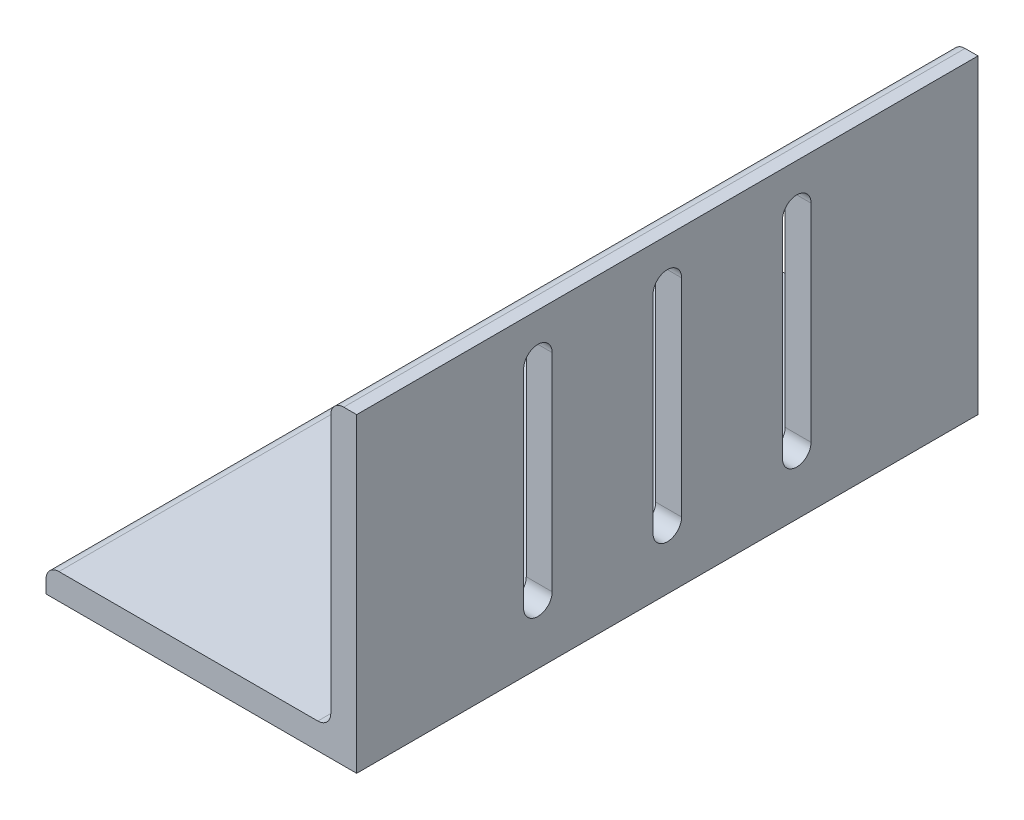
ISO-10303-21;
HEADER;
FILE_DESCRIPTION(('STEP AP214'),'2;1');
FILE_NAME('part.step','',(''),(''),'','','');
FILE_SCHEMA(('AUTOMOTIVE_DESIGN { 1 0 10303 214 1 1 1 1 }'));
ENDSEC;
DATA;
#1=APPLICATION_CONTEXT('core data for automotive mechanical design processes');
#2=APPLICATION_PROTOCOL_DEFINITION('international standard','automotive_design',2000,#1);
#3=PRODUCT_CONTEXT('',#1,'mechanical');
#4=PRODUCT('Part','Part','',(#3));
#5=PRODUCT_RELATED_PRODUCT_CATEGORY('part','',(#4));
#6=PRODUCT_DEFINITION_FORMATION('','',#4);
#7=PRODUCT_DEFINITION_CONTEXT('part definition',#1,'design');
#8=PRODUCT_DEFINITION('design','',#6,#7);
#9=PRODUCT_DEFINITION_SHAPE('','',#8);
#10=(LENGTH_UNIT() NAMED_UNIT(*) SI_UNIT(.MILLI.,.METRE.));
#11=(NAMED_UNIT(*) PLANE_ANGLE_UNIT() SI_UNIT($,.RADIAN.));
#12=(NAMED_UNIT(*) SI_UNIT($,.STERADIAN.) SOLID_ANGLE_UNIT());
#13=UNCERTAINTY_MEASURE_WITH_UNIT(LENGTH_MEASURE(1.E-05),#10,'distance_accuracy_value','');
#14=(GEOMETRIC_REPRESENTATION_CONTEXT(3) GLOBAL_UNCERTAINTY_ASSIGNED_CONTEXT((#13)) GLOBAL_UNIT_ASSIGNED_CONTEXT((#10,
#11,#12)) REPRESENTATION_CONTEXT('',''));
#15=CARTESIAN_POINT('',(0.,0.,0.));
#16=DIRECTION('',(0.,0.,1.));
#17=DIRECTION('',(1.,0.,0.));
#18=AXIS2_PLACEMENT_3D('',#15,#16,#17);
#19=CARTESIAN_POINT('',(-38.1,3.175,76.2));
#20=DIRECTION('',(1.,0.,0.));
#21=DIRECTION('',(0.,0.,-1.));
#22=AXIS2_PLACEMENT_3D('',#19,#20,#21);
#23=PLANE('',#22);
#24=DIRECTION('',(0.,-1.,0.));
#25=VECTOR('',#24,1.);
#26=CARTESIAN_POINT('',(-38.1,3.175,-76.2));
#27=LINE('',#26,#25);
#28=CARTESIAN_POINT('',(-38.1,3.175,-76.2));
#29=VERTEX_POINT('',#28);
#30=CARTESIAN_POINT('',(-38.1,0.,-76.2));
#31=VERTEX_POINT('',#30);
#32=EDGE_CURVE('E214',#29,#31,#27,.T.);
#33=ORIENTED_EDGE('',*,*,#32,.T.);
#34=DIRECTION('',(0.,0.,-1.));
#35=VECTOR('',#34,1.);
#36=CARTESIAN_POINT('',(-38.1,0.,76.2));
#37=LINE('',#36,#35);
#38=CARTESIAN_POINT('',(-38.1,0.,76.2));
#39=VERTEX_POINT('',#38);
#40=EDGE_CURVE('E316',#39,#31,#37,.T.);
#41=ORIENTED_EDGE('',*,*,#40,.F.);
#42=DIRECTION('',(0.,-1.,0.));
#43=VECTOR('',#42,1.);
#44=CARTESIAN_POINT('',(-38.1,3.175,76.2));
#45=LINE('',#44,#43);
#46=CARTESIAN_POINT('',(-38.1,3.175,76.2));
#47=VERTEX_POINT('',#46);
#48=EDGE_CURVE('E255',#47,#39,#45,.T.);
#49=ORIENTED_EDGE('',*,*,#48,.F.);
#50=DIRECTION('',(0.,0.,-1.));
#51=VECTOR('',#50,1.);
#52=CARTESIAN_POINT('',(-38.1,3.175,76.2));
#53=LINE('',#52,#51);
#54=EDGE_CURVE('E275',#47,#29,#53,.T.);
#55=ORIENTED_EDGE('',*,*,#54,.T.);
#56=EDGE_LOOP('',(#33,#41,#49,#55));
#57=FACE_BOUND('',#56,.T.);
#58=ADVANCED_FACE('F39',(#57),#23,.F.);
#59=CARTESIAN_POINT('',(-38.1,0.,76.2));
#60=DIRECTION('',(0.,1.,0.));
#61=DIRECTION('',(0.,0.,1.));
#62=AXIS2_PLACEMENT_3D('',#59,#60,#61);
#63=PLANE('',#62);
#64=CARTESIAN_POINT('',(-12.35,0.,-25.4));
#65=DIRECTION('',(0.,-1.,0.));
#66=DIRECTION('',(0.,0.,1.));
#67=AXIS2_PLACEMENT_3D('',#64,#65,#66);
#68=CIRCLE('',#67,3.5);
#69=CARTESIAN_POINT('',(-12.35,0.,-21.9));
#70=VERTEX_POINT('',#69);
#71=EDGE_CURVE('E498',#70,#70,#68,.T.);
#72=ORIENTED_EDGE('',*,*,#71,.F.);
#73=EDGE_LOOP('',(#72));
#74=FACE_BOUND('',#73,.T.);
#75=CARTESIAN_POINT('',(-12.35,0.,25.4));
#76=DIRECTION('',(0.,-1.,0.));
#77=DIRECTION('',(0.,0.,-1.));
#78=AXIS2_PLACEMENT_3D('',#75,#76,#77);
#79=CIRCLE('',#78,3.5);
#80=CARTESIAN_POINT('',(-12.35,0.,21.9));
#81=VERTEX_POINT('',#80);
#82=EDGE_CURVE('E495',#81,#81,#79,.T.);
#83=ORIENTED_EDGE('',*,*,#82,.F.);
#84=EDGE_LOOP('',(#83));
#85=FACE_BOUND('',#84,.T.);
#86=CARTESIAN_POINT('',(-12.35,0.,0.));
#87=DIRECTION('',(0.,-1.,0.));
#88=DIRECTION('',(0.,0.,-1.));
#89=AXIS2_PLACEMENT_3D('',#86,#87,#88);
#90=CIRCLE('',#89,3.5);
#91=CARTESIAN_POINT('',(-12.35,0.,-3.50000000000003));
#92=VERTEX_POINT('',#91);
#93=EDGE_CURVE('E351',#92,#92,#90,.T.);
#94=ORIENTED_EDGE('',*,*,#93,.F.);
#95=EDGE_LOOP('',(#94));
#96=FACE_BOUND('',#95,.T.);
#97=DIRECTION('',(1.,0.,0.));
#98=VECTOR('',#97,1.);
#99=CARTESIAN_POINT('',(-38.1,0.,-76.2));
#100=LINE('',#99,#98);
#101=CARTESIAN_POINT('',(38.1,0.,-76.2));
#102=VERTEX_POINT('',#101);
#103=EDGE_CURVE('E278',#31,#102,#100,.T.);
#104=ORIENTED_EDGE('',*,*,#103,.T.);
#105=DIRECTION('',(0.,0.,-1.));
#106=VECTOR('',#105,1.);
#107=CARTESIAN_POINT('',(38.1,0.,76.2));
#108=LINE('',#107,#106);
#109=CARTESIAN_POINT('',(38.1,0.,76.2));
#110=VERTEX_POINT('',#109);
#111=EDGE_CURVE('E313',#110,#102,#108,.T.);
#112=ORIENTED_EDGE('',*,*,#111,.F.);
#113=DIRECTION('',(1.,0.,0.));
#114=VECTOR('',#113,1.);
#115=CARTESIAN_POINT('',(-38.1,0.,76.2));
#116=LINE('',#115,#114);
#117=EDGE_CURVE('E258',#39,#110,#116,.T.);
#118=ORIENTED_EDGE('',*,*,#117,.F.);
#119=ORIENTED_EDGE('',*,*,#40,.T.);
#120=EDGE_LOOP('',(#104,#112,#118,#119));
#121=FACE_BOUND('',#120,.T.);
#122=ADVANCED_FACE('F374',(#74,#85,#96,#121),#63,.F.);
#123=CARTESIAN_POINT('',(38.1,0.,76.2));
#124=DIRECTION('',(-1.,0.,0.));
#125=DIRECTION('',(0.,0.,1.));
#126=AXIS2_PLACEMENT_3D('',#123,#124,#125);
#127=PLANE('',#126);
#128=DIRECTION('',(0.,-1.,0.));
#129=VECTOR('',#128,1.);
#130=CARTESIAN_POINT('',(38.1,65.4,35.25));
#131=LINE('',#130,#129);
#132=CARTESIAN_POINT('',(38.1,65.4,35.25));
#133=VERTEX_POINT('',#132);
#134=CARTESIAN_POINT('',(38.1,14.6,35.25));
#135=VERTEX_POINT('',#134);
#136=EDGE_CURVE('E200',#133,#135,#131,.T.);
#137=ORIENTED_EDGE('',*,*,#136,.F.);
#138=CARTESIAN_POINT('',(38.1,65.4,31.75));
#139=DIRECTION('',(1.,0.,0.));
#140=DIRECTION('',(0.,1.,0.));
#141=AXIS2_PLACEMENT_3D('',#138,#139,#140);
#142=CIRCLE('',#141,3.5);
#143=CARTESIAN_POINT('',(38.1,65.4,28.25));
#144=VERTEX_POINT('',#143);
#145=EDGE_CURVE('E55',#144,#133,#142,.T.);
#146=ORIENTED_EDGE('',*,*,#145,.F.);
#147=DIRECTION('',(0.,1.,0.));
#148=VECTOR('',#147,1.);
#149=CARTESIAN_POINT('',(38.1,65.4,28.25));
#150=LINE('',#149,#148);
#151=CARTESIAN_POINT('',(38.1,14.6,28.25));
#152=VERTEX_POINT('',#151);
#153=EDGE_CURVE('E207',#152,#144,#150,.T.);
#154=ORIENTED_EDGE('',*,*,#153,.F.);
#155=CARTESIAN_POINT('',(38.1,14.6,31.75));
#156=DIRECTION('',(1.,0.,0.));
#157=DIRECTION('',(0.,1.,0.));
#158=AXIS2_PLACEMENT_3D('',#155,#156,#157);
#159=CIRCLE('',#158,3.5);
#160=EDGE_CURVE('E190',#135,#152,#159,.T.);
#161=ORIENTED_EDGE('',*,*,#160,.F.);
#162=EDGE_LOOP('',(#137,#146,#154,#161));
#163=FACE_BOUND('',#162,.T.);
#164=DIRECTION('',(0.,-1.,0.));
#165=VECTOR('',#164,1.);
#166=CARTESIAN_POINT('',(38.1,65.4,-28.25));
#167=LINE('',#166,#165);
#168=CARTESIAN_POINT('',(38.1,65.4,-28.25));
#169=VERTEX_POINT('',#168);
#170=CARTESIAN_POINT('',(38.1,14.6,-28.25));
#171=VERTEX_POINT('',#170);
#172=EDGE_CURVE('E218',#169,#171,#167,.T.);
#173=ORIENTED_EDGE('',*,*,#172,.F.);
#174=CARTESIAN_POINT('',(38.1,65.4,-31.75));
#175=DIRECTION('',(1.,0.,0.));
#176=DIRECTION('',(0.,-1.,0.));
#177=AXIS2_PLACEMENT_3D('',#174,#175,#176);
#178=CIRCLE('',#177,3.5);
#179=CARTESIAN_POINT('',(38.1,65.4,-35.25));
#180=VERTEX_POINT('',#179);
#181=EDGE_CURVE('E63',#180,#169,#178,.T.);
#182=ORIENTED_EDGE('',*,*,#181,.F.);
#183=DIRECTION('',(0.,1.,0.));
#184=VECTOR('',#183,1.);
#185=CARTESIAN_POINT('',(38.1,65.4,-35.25));
#186=LINE('',#185,#184);
#187=CARTESIAN_POINT('',(38.1,14.6,-35.25));
#188=VERTEX_POINT('',#187);
#189=EDGE_CURVE('E225',#188,#180,#186,.T.);
#190=ORIENTED_EDGE('',*,*,#189,.F.);
#191=CARTESIAN_POINT('',(38.1,14.6,-31.75));
#192=DIRECTION('',(1.,0.,0.));
#193=DIRECTION('',(0.,-1.,0.));
#194=AXIS2_PLACEMENT_3D('',#191,#192,#193);
#195=CIRCLE('',#194,3.5);
#196=EDGE_CURVE('E222',#171,#188,#195,.T.);
#197=ORIENTED_EDGE('',*,*,#196,.F.);
#198=EDGE_LOOP('',(#173,#182,#190,#197));
#199=FACE_BOUND('',#198,.T.);
#200=DIRECTION('',(0.,-1.,0.));
#201=VECTOR('',#200,1.);
#202=CARTESIAN_POINT('',(38.1,65.4,3.50000000000001));
#203=LINE('',#202,#201);
#204=CARTESIAN_POINT('',(38.1,65.4,3.50000000000001));
#205=VERTEX_POINT('',#204);
#206=CARTESIAN_POINT('',(38.1,14.6,3.50000000000001));
#207=VERTEX_POINT('',#206);
#208=EDGE_CURVE('E238',#205,#207,#203,.T.);
#209=ORIENTED_EDGE('',*,*,#208,.F.);
#210=CARTESIAN_POINT('',(38.1,65.4,0.));
#211=DIRECTION('',(1.,0.,0.));
#212=DIRECTION('',(0.,1.,0.));
#213=AXIS2_PLACEMENT_3D('',#210,#211,#212);
#214=CIRCLE('',#213,3.5);
#215=CARTESIAN_POINT('',(38.1,65.4,-3.49999999999999));
#216=VERTEX_POINT('',#215);
#217=EDGE_CURVE('E236',#216,#205,#214,.T.);
#218=ORIENTED_EDGE('',*,*,#217,.F.);
#219=DIRECTION('',(0.,1.,0.));
#220=VECTOR('',#219,1.);
#221=CARTESIAN_POINT('',(38.1,65.4,-3.49999999999999));
#222=LINE('',#221,#220);
#223=CARTESIAN_POINT('',(38.1,14.6,-3.49999999999999));
#224=VERTEX_POINT('',#223);
#225=EDGE_CURVE('E244',#224,#216,#222,.T.);
#226=ORIENTED_EDGE('',*,*,#225,.F.);
#227=CARTESIAN_POINT('',(38.1,14.6,0.));
#228=DIRECTION('',(1.,0.,0.));
#229=DIRECTION('',(0.,1.,0.));
#230=AXIS2_PLACEMENT_3D('',#227,#228,#229);
#231=CIRCLE('',#230,3.5);
#232=EDGE_CURVE('E241',#207,#224,#231,.T.);
#233=ORIENTED_EDGE('',*,*,#232,.F.);
#234=EDGE_LOOP('',(#209,#218,#226,#233));
#235=FACE_BOUND('',#234,.T.);
#236=DIRECTION('',(0.,1.,0.));
#237=VECTOR('',#236,1.);
#238=CARTESIAN_POINT('',(38.1,0.,-76.2));
#239=LINE('',#238,#237);
#240=CARTESIAN_POINT('',(38.1,76.2,-76.2));
#241=VERTEX_POINT('',#240);
#242=EDGE_CURVE('E280',#102,#241,#239,.T.);
#243=ORIENTED_EDGE('',*,*,#242,.T.);
#244=DIRECTION('',(0.,0.,-1.));
#245=VECTOR('',#244,1.);
#246=CARTESIAN_POINT('',(38.1,76.2,76.2));
#247=LINE('',#246,#245);
#248=CARTESIAN_POINT('',(38.1,76.2,76.2));
#249=VERTEX_POINT('',#248);
#250=EDGE_CURVE('E310',#249,#241,#247,.T.);
#251=ORIENTED_EDGE('',*,*,#250,.F.);
#252=DIRECTION('',(0.,1.,0.));
#253=VECTOR('',#252,1.);
#254=CARTESIAN_POINT('',(38.1,0.,76.2));
#255=LINE('',#254,#253);
#256=EDGE_CURVE('E261',#110,#249,#255,.T.);
#257=ORIENTED_EDGE('',*,*,#256,.F.);
#258=ORIENTED_EDGE('',*,*,#111,.T.);
#259=EDGE_LOOP('',(#243,#251,#257,#258));
#260=FACE_BOUND('',#259,.T.);
#261=ADVANCED_FACE('F204',(#163,#199,#235,#260),#127,.F.);
#262=CARTESIAN_POINT('',(34.925,76.2,76.2));
#263=DIRECTION('',(0.,-1.,0.));
#264=DIRECTION('',(0.,0.,-1.));
#265=AXIS2_PLACEMENT_3D('',#262,#263,#264);
#266=PLANE('',#265);
#267=DIRECTION('',(-1.,0.,0.));
#268=VECTOR('',#267,1.);
#269=CARTESIAN_POINT('',(34.925,76.2,-76.2));
#270=LINE('',#269,#268);
#271=CARTESIAN_POINT('',(34.925,76.2,-76.2));
#272=VERTEX_POINT('',#271);
#273=EDGE_CURVE('E282',#241,#272,#270,.T.);
#274=ORIENTED_EDGE('',*,*,#273,.T.);
#275=DIRECTION('',(0.,0.,-1.));
#276=VECTOR('',#275,1.);
#277=CARTESIAN_POINT('',(34.925,76.2,76.2));
#278=LINE('',#277,#276);
#279=CARTESIAN_POINT('',(34.925,76.2,76.2));
#280=VERTEX_POINT('',#279);
#281=EDGE_CURVE('E307',#280,#272,#278,.T.);
#282=ORIENTED_EDGE('',*,*,#281,.F.);
#283=DIRECTION('',(-1.,0.,0.));
#284=VECTOR('',#283,1.);
#285=CARTESIAN_POINT('',(34.925,76.2,76.2));
#286=LINE('',#285,#284);
#287=EDGE_CURVE('E263',#249,#280,#286,.T.);
#288=ORIENTED_EDGE('',*,*,#287,.F.);
#289=ORIENTED_EDGE('',*,*,#250,.T.);
#290=EDGE_LOOP('',(#274,#282,#288,#289));
#291=FACE_BOUND('',#290,.T.);
#292=ADVANCED_FACE('F418',(#291),#266,.F.);
#293=CARTESIAN_POINT('',(34.925,73.025,76.2));
#294=DIRECTION('',(0.,0.,-1.));
#295=DIRECTION('',(-1.,0.,0.));
#296=AXIS2_PLACEMENT_3D('',#293,#294,#295);
#297=CYLINDRICAL_SURFACE('',#296,3.175);
#298=CARTESIAN_POINT('',(34.925,73.025,-76.2));
#299=DIRECTION('',(0.,0.,1.));
#300=DIRECTION('',(-1.,0.,0.));
#301=AXIS2_PLACEMENT_3D('',#298,#299,#300);
#302=CIRCLE('',#301,3.175);
#303=CARTESIAN_POINT('',(31.75,73.025,-76.2));
#304=VERTEX_POINT('',#303);
#305=EDGE_CURVE('E284',#272,#304,#302,.T.);
#306=ORIENTED_EDGE('',*,*,#305,.T.);
#307=DIRECTION('',(0.,0.,-1.));
#308=VECTOR('',#307,1.);
#309=CARTESIAN_POINT('',(31.75,73.025,76.2));
#310=LINE('',#309,#308);
#311=CARTESIAN_POINT('',(31.75,73.025,76.2));
#312=VERTEX_POINT('',#311);
#313=EDGE_CURVE('E304',#312,#304,#310,.T.);
#314=ORIENTED_EDGE('',*,*,#313,.F.);
#315=CARTESIAN_POINT('',(34.925,73.025,76.2));
#316=DIRECTION('',(0.,0.,1.));
#317=DIRECTION('',(-1.,0.,0.));
#318=AXIS2_PLACEMENT_3D('',#315,#316,#317);
#319=CIRCLE('',#318,3.175);
#320=EDGE_CURVE('E265',#280,#312,#319,.T.);
#321=ORIENTED_EDGE('',*,*,#320,.F.);
#322=ORIENTED_EDGE('',*,*,#281,.T.);
#323=EDGE_LOOP('',(#306,#314,#321,#322));
#324=FACE_BOUND('',#323,.T.);
#325=ADVANCED_FACE('F415',(#324),#297,.T.);
#326=CARTESIAN_POINT('',(31.75,73.025,76.2));
#327=DIRECTION('',(1.,0.,0.));
#328=DIRECTION('',(0.,1.,0.));
#329=AXIS2_PLACEMENT_3D('',#326,#327,#328);
#330=PLANE('',#329);
#331=DIRECTION('',(0.,1.,0.));
#332=VECTOR('',#331,1.);
#333=CARTESIAN_POINT('',(31.75,73.025,28.25));
#334=LINE('',#333,#332);
#335=CARTESIAN_POINT('',(31.75,14.6,28.25));
#336=VERTEX_POINT('',#335);
#337=CARTESIAN_POINT('',(31.75,65.4,28.25));
#338=VERTEX_POINT('',#337);
#339=EDGE_CURVE('E47',#336,#338,#334,.T.);
#340=ORIENTED_EDGE('',*,*,#339,.T.);
#341=CARTESIAN_POINT('',(31.75,65.4,31.75));
#342=DIRECTION('',(1.,0.,0.));
#343=DIRECTION('',(0.,1.,0.));
#344=AXIS2_PLACEMENT_3D('',#341,#342,#343);
#345=CIRCLE('',#344,3.5);
#346=CARTESIAN_POINT('',(31.75,65.4,35.25));
#347=VERTEX_POINT('',#346);
#348=EDGE_CURVE('E11',#338,#347,#345,.T.);
#349=ORIENTED_EDGE('',*,*,#348,.T.);
#350=DIRECTION('',(0.,-1.,0.));
#351=VECTOR('',#350,1.);
#352=CARTESIAN_POINT('',(31.75,73.025,35.25));
#353=LINE('',#352,#351);
#354=CARTESIAN_POINT('',(31.75,14.6,35.25));
#355=VERTEX_POINT('',#354);
#356=EDGE_CURVE('E343',#347,#355,#353,.T.);
#357=ORIENTED_EDGE('',*,*,#356,.T.);
#358=CARTESIAN_POINT('',(31.75,14.6,31.75));
#359=DIRECTION('',(1.,0.,0.));
#360=DIRECTION('',(0.,1.,0.));
#361=AXIS2_PLACEMENT_3D('',#358,#359,#360);
#362=CIRCLE('',#361,3.5);
#363=EDGE_CURVE('E193',#355,#336,#362,.T.);
#364=ORIENTED_EDGE('',*,*,#363,.T.);
#365=EDGE_LOOP('',(#340,#349,#357,#364));
#366=FACE_BOUND('',#365,.T.);
#367=DIRECTION('',(0.,1.,0.));
#368=VECTOR('',#367,1.);
#369=CARTESIAN_POINT('',(31.75,73.025,-35.25));
#370=LINE('',#369,#368);
#371=CARTESIAN_POINT('',(31.75,14.6,-35.25));
#372=VERTEX_POINT('',#371);
#373=CARTESIAN_POINT('',(31.75,65.4,-35.25));
#374=VERTEX_POINT('',#373);
#375=EDGE_CURVE('E337',#372,#374,#370,.T.);
#376=ORIENTED_EDGE('',*,*,#375,.T.);
#377=CARTESIAN_POINT('',(31.75,65.4,-31.75));
#378=DIRECTION('',(1.,0.,0.));
#379=DIRECTION('',(0.,1.,0.));
#380=AXIS2_PLACEMENT_3D('',#377,#378,#379);
#381=CIRCLE('',#380,3.5);
#382=CARTESIAN_POINT('',(31.75,65.4,-28.25));
#383=VERTEX_POINT('',#382);
#384=EDGE_CURVE('E340',#374,#383,#381,.T.);
#385=ORIENTED_EDGE('',*,*,#384,.T.);
#386=DIRECTION('',(0.,-1.,0.));
#387=VECTOR('',#386,1.);
#388=CARTESIAN_POINT('',(31.75,73.025,-28.25));
#389=LINE('',#388,#387);
#390=CARTESIAN_POINT('',(31.75,14.6,-28.25));
#391=VERTEX_POINT('',#390);
#392=EDGE_CURVE('E331',#383,#391,#389,.T.);
#393=ORIENTED_EDGE('',*,*,#392,.T.);
#394=CARTESIAN_POINT('',(31.75,14.6,-31.75));
#395=DIRECTION('',(1.,0.,0.));
#396=DIRECTION('',(0.,1.,0.));
#397=AXIS2_PLACEMENT_3D('',#394,#395,#396);
#398=CIRCLE('',#397,3.5);
#399=EDGE_CURVE('E334',#391,#372,#398,.T.);
#400=ORIENTED_EDGE('',*,*,#399,.T.);
#401=EDGE_LOOP('',(#376,#385,#393,#400));
#402=FACE_BOUND('',#401,.T.);
#403=DIRECTION('',(0.,1.,0.));
#404=VECTOR('',#403,1.);
#405=CARTESIAN_POINT('',(31.75,73.025,-3.49999999999999));
#406=LINE('',#405,#404);
#407=CARTESIAN_POINT('',(31.75,14.6,-3.49999999999999));
#408=VERTEX_POINT('',#407);
#409=CARTESIAN_POINT('',(31.75,65.4,-3.49999999999999));
#410=VERTEX_POINT('',#409);
#411=EDGE_CURVE('E325',#408,#410,#406,.T.);
#412=ORIENTED_EDGE('',*,*,#411,.T.);
#413=CARTESIAN_POINT('',(31.75,65.4,0.));
#414=DIRECTION('',(1.,0.,0.));
#415=DIRECTION('',(0.,1.,0.));
#416=AXIS2_PLACEMENT_3D('',#413,#414,#415);
#417=CIRCLE('',#416,3.5);
#418=CARTESIAN_POINT('',(31.75,65.4,3.50000000000001));
#419=VERTEX_POINT('',#418);
#420=EDGE_CURVE('E328',#410,#419,#417,.T.);
#421=ORIENTED_EDGE('',*,*,#420,.T.);
#422=DIRECTION('',(0.,-1.,0.));
#423=VECTOR('',#422,1.);
#424=CARTESIAN_POINT('',(31.75,73.025,3.50000000000002));
#425=LINE('',#424,#423);
#426=CARTESIAN_POINT('',(31.75,14.6,3.50000000000001));
#427=VERTEX_POINT('',#426);
#428=EDGE_CURVE('E319',#419,#427,#425,.T.);
#429=ORIENTED_EDGE('',*,*,#428,.T.);
#430=CARTESIAN_POINT('',(31.75,14.6,0.));
#431=DIRECTION('',(1.,0.,0.));
#432=DIRECTION('',(0.,1.,0.));
#433=AXIS2_PLACEMENT_3D('',#430,#431,#432);
#434=CIRCLE('',#433,3.5);
#435=EDGE_CURVE('E322',#427,#408,#434,.T.);
#436=ORIENTED_EDGE('',*,*,#435,.T.);
#437=EDGE_LOOP('',(#412,#421,#429,#436));
#438=FACE_BOUND('',#437,.T.);
#439=DIRECTION('',(0.,-1.,0.));
#440=VECTOR('',#439,1.);
#441=CARTESIAN_POINT('',(31.75,73.025,-76.2));
#442=LINE('',#441,#440);
#443=CARTESIAN_POINT('',(31.75,9.52499999999999,-76.2));
#444=VERTEX_POINT('',#443);
#445=EDGE_CURVE('E286',#304,#444,#442,.T.);
#446=ORIENTED_EDGE('',*,*,#445,.T.);
#447=DIRECTION('',(0.,0.,-1.));
#448=VECTOR('',#447,1.);
#449=CARTESIAN_POINT('',(31.75,9.52499999999999,76.2));
#450=LINE('',#449,#448);
#451=CARTESIAN_POINT('',(31.75,9.52499999999999,76.2));
#452=VERTEX_POINT('',#451);
#453=EDGE_CURVE('E301',#452,#444,#450,.T.);
#454=ORIENTED_EDGE('',*,*,#453,.F.);
#455=DIRECTION('',(0.,-1.,0.));
#456=VECTOR('',#455,1.);
#457=CARTESIAN_POINT('',(31.75,73.025,76.2));
#458=LINE('',#457,#456);
#459=EDGE_CURVE('E267',#312,#452,#458,.T.);
#460=ORIENTED_EDGE('',*,*,#459,.F.);
#461=ORIENTED_EDGE('',*,*,#313,.T.);
#462=EDGE_LOOP('',(#446,#454,#460,#461));
#463=FACE_BOUND('',#462,.T.);
#464=ADVANCED_FACE('F411',(#366,#402,#438,#463),#330,.F.);
#465=CARTESIAN_POINT('',(28.575,9.52499999999999,76.2));
#466=DIRECTION('',(0.,0.,-1.));
#467=DIRECTION('',(-1.,0.,0.));
#468=AXIS2_PLACEMENT_3D('',#465,#466,#467);
#469=CYLINDRICAL_SURFACE('',#468,3.175);
#470=CARTESIAN_POINT('',(28.575,9.52499999999999,-76.2));
#471=DIRECTION('',(0.,0.,-1.));
#472=DIRECTION('',(-1.,0.,0.));
#473=AXIS2_PLACEMENT_3D('',#470,#471,#472);
#474=CIRCLE('',#473,3.175);
#475=CARTESIAN_POINT('',(28.575,6.35,-76.2));
#476=VERTEX_POINT('',#475);
#477=EDGE_CURVE('E288',#444,#476,#474,.T.);
#478=ORIENTED_EDGE('',*,*,#477,.T.);
#479=DIRECTION('',(0.,0.,-1.));
#480=VECTOR('',#479,1.);
#481=CARTESIAN_POINT('',(28.575,6.35,76.2));
#482=LINE('',#481,#480);
#483=CARTESIAN_POINT('',(28.575,6.35,76.2));
#484=VERTEX_POINT('',#483);
#485=EDGE_CURVE('E298',#484,#476,#482,.T.);
#486=ORIENTED_EDGE('',*,*,#485,.F.);
#487=CARTESIAN_POINT('',(28.575,9.52499999999999,76.2));
#488=DIRECTION('',(0.,0.,-1.));
#489=DIRECTION('',(-1.,0.,0.));
#490=AXIS2_PLACEMENT_3D('',#487,#488,#489);
#491=CIRCLE('',#490,3.175);
#492=EDGE_CURVE('E269',#452,#484,#491,.T.);
#493=ORIENTED_EDGE('',*,*,#492,.F.);
#494=ORIENTED_EDGE('',*,*,#453,.T.);
#495=EDGE_LOOP('',(#478,#486,#493,#494));
#496=FACE_BOUND('',#495,.T.);
#497=ADVANCED_FACE('F406',(#496),#469,.F.);
#498=CARTESIAN_POINT('',(28.575,6.35,76.2));
#499=DIRECTION('',(0.,-1.,0.));
#500=DIRECTION('',(1.,0.,0.));
#501=AXIS2_PLACEMENT_3D('',#498,#499,#500);
#502=PLANE('',#501);
#503=CARTESIAN_POINT('',(-12.35,6.35,-25.4));
#504=DIRECTION('',(0.,-1.,0.));
#505=DIRECTION('',(1.,0.,0.));
#506=AXIS2_PLACEMENT_3D('',#503,#504,#505);
#507=CIRCLE('',#506,3.5);
#508=CARTESIAN_POINT('',(-8.85,6.35,-25.4));
#509=VERTEX_POINT('',#508);
#510=EDGE_CURVE('E42',#509,#509,#507,.T.);
#511=ORIENTED_EDGE('',*,*,#510,.T.);
#512=EDGE_LOOP('',(#511));
#513=FACE_BOUND('',#512,.T.);
#514=CARTESIAN_POINT('',(-12.35,6.35,25.4));
#515=DIRECTION('',(0.,-1.,0.));
#516=DIRECTION('',(1.,0.,0.));
#517=AXIS2_PLACEMENT_3D('',#514,#515,#516);
#518=CIRCLE('',#517,3.5);
#519=CARTESIAN_POINT('',(-8.85,6.35,25.4));
#520=VERTEX_POINT('',#519);
#521=EDGE_CURVE('E350',#520,#520,#518,.T.);
#522=ORIENTED_EDGE('',*,*,#521,.T.);
#523=EDGE_LOOP('',(#522));
#524=FACE_BOUND('',#523,.T.);
#525=CARTESIAN_POINT('',(-12.35,6.35,0.));
#526=DIRECTION('',(0.,-1.,0.));
#527=DIRECTION('',(1.,0.,0.));
#528=AXIS2_PLACEMENT_3D('',#525,#526,#527);
#529=CIRCLE('',#528,3.5);
#530=CARTESIAN_POINT('',(-8.85,6.35,0.));
#531=VERTEX_POINT('',#530);
#532=EDGE_CURVE('E348',#531,#531,#529,.T.);
#533=ORIENTED_EDGE('',*,*,#532,.T.);
#534=EDGE_LOOP('',(#533));
#535=FACE_BOUND('',#534,.T.);
#536=DIRECTION('',(-1.,0.,0.));
#537=VECTOR('',#536,1.);
#538=CARTESIAN_POINT('',(28.575,6.35,-76.2));
#539=LINE('',#538,#537);
#540=CARTESIAN_POINT('',(-34.925,6.34999999999999,-76.2));
#541=VERTEX_POINT('',#540);
#542=EDGE_CURVE('E290',#476,#541,#539,.T.);
#543=ORIENTED_EDGE('',*,*,#542,.T.);
#544=DIRECTION('',(0.,0.,-1.));
#545=VECTOR('',#544,1.);
#546=CARTESIAN_POINT('',(-34.925,6.34999999999999,76.2));
#547=LINE('',#546,#545);
#548=CARTESIAN_POINT('',(-34.925,6.34999999999999,76.2));
#549=VERTEX_POINT('',#548);
#550=EDGE_CURVE('E295',#549,#541,#547,.T.);
#551=ORIENTED_EDGE('',*,*,#550,.F.);
#552=DIRECTION('',(-1.,0.,0.));
#553=VECTOR('',#552,1.);
#554=CARTESIAN_POINT('',(28.575,6.35,76.2));
#555=LINE('',#554,#553);
#556=EDGE_CURVE('E271',#484,#549,#555,.T.);
#557=ORIENTED_EDGE('',*,*,#556,.F.);
#558=ORIENTED_EDGE('',*,*,#485,.T.);
#559=EDGE_LOOP('',(#543,#551,#557,#558));
#560=FACE_BOUND('',#559,.T.);
#561=ADVANCED_FACE('F358',(#513,#524,#535,#560),#502,.F.);
#562=CARTESIAN_POINT('',(-34.925,3.175,76.2));
#563=DIRECTION('',(0.,0.,-1.));
#564=DIRECTION('',(-1.,0.,0.));
#565=AXIS2_PLACEMENT_3D('',#562,#563,#564);
#566=CYLINDRICAL_SURFACE('',#565,3.175);
#567=CARTESIAN_POINT('',(-34.925,3.175,-76.2));
#568=DIRECTION('',(0.,0.,1.));
#569=DIRECTION('',(-1.,0.,0.));
#570=AXIS2_PLACEMENT_3D('',#567,#568,#569);
#571=CIRCLE('',#570,3.175);
#572=EDGE_CURVE('E259',#541,#29,#571,.T.);
#573=ORIENTED_EDGE('',*,*,#572,.T.);
#574=ORIENTED_EDGE('',*,*,#54,.F.);
#575=CARTESIAN_POINT('',(-34.925,3.175,76.2));
#576=DIRECTION('',(0.,0.,1.));
#577=DIRECTION('',(-1.,0.,0.));
#578=AXIS2_PLACEMENT_3D('',#575,#576,#577);
#579=CIRCLE('',#578,3.175);
#580=EDGE_CURVE('E273',#549,#47,#579,.T.);
#581=ORIENTED_EDGE('',*,*,#580,.F.);
#582=ORIENTED_EDGE('',*,*,#550,.T.);
#583=EDGE_LOOP('',(#573,#574,#581,#582));
#584=FACE_BOUND('',#583,.T.);
#585=ADVANCED_FACE('F399',(#584),#566,.T.);
#586=CARTESIAN_POINT('',(34.925,73.025,76.2));
#587=DIRECTION('',(0.,0.,-1.));
#588=DIRECTION('',(-1.,0.,0.));
#589=AXIS2_PLACEMENT_3D('',#586,#587,#588);
#590=PLANE('',#589);
#591=ORIENTED_EDGE('',*,*,#48,.T.);
#592=ORIENTED_EDGE('',*,*,#117,.T.);
#593=ORIENTED_EDGE('',*,*,#256,.T.);
#594=ORIENTED_EDGE('',*,*,#287,.T.);
#595=ORIENTED_EDGE('',*,*,#320,.T.);
#596=ORIENTED_EDGE('',*,*,#459,.T.);
#597=ORIENTED_EDGE('',*,*,#492,.T.);
#598=ORIENTED_EDGE('',*,*,#556,.T.);
#599=ORIENTED_EDGE('',*,*,#580,.T.);
#600=EDGE_LOOP('',(#591,#592,#593,#594,#595,#596,#597,#598,#599));
#601=FACE_BOUND('',#600,.T.);
#602=ADVANCED_FACE('F394',(#601),#590,.F.);
#603=CARTESIAN_POINT('',(34.925,73.025,-76.2));
#604=DIRECTION('',(0.,0.,-1.));
#605=DIRECTION('',(-1.,0.,0.));
#606=AXIS2_PLACEMENT_3D('',#603,#604,#605);
#607=PLANE('',#606);
#608=ORIENTED_EDGE('',*,*,#32,.F.);
#609=ORIENTED_EDGE('',*,*,#572,.F.);
#610=ORIENTED_EDGE('',*,*,#542,.F.);
#611=ORIENTED_EDGE('',*,*,#477,.F.);
#612=ORIENTED_EDGE('',*,*,#445,.F.);
#613=ORIENTED_EDGE('',*,*,#305,.F.);
#614=ORIENTED_EDGE('',*,*,#273,.F.);
#615=ORIENTED_EDGE('',*,*,#242,.F.);
#616=ORIENTED_EDGE('',*,*,#103,.F.);
#617=EDGE_LOOP('',(#608,#609,#610,#611,#612,#613,#614,#615,#616));
#618=FACE_BOUND('',#617,.T.);
#619=ADVANCED_FACE('F386',(#618),#607,.T.);
#620=CARTESIAN_POINT('',(28.1,65.4,0.));
#621=DIRECTION('',(1.,0.,0.));
#622=DIRECTION('',(0.,1.,0.));
#623=AXIS2_PLACEMENT_3D('',#620,#621,#622);
#624=CYLINDRICAL_SURFACE('',#623,3.5);
#625=DIRECTION('',(1.,0.,0.));
#626=VECTOR('',#625,1.);
#627=CARTESIAN_POINT('',(28.1,65.4,-3.49999999999999));
#628=LINE('',#627,#626);
#629=EDGE_CURVE('E219',#410,#216,#628,.T.);
#630=ORIENTED_EDGE('',*,*,#629,.T.);
#631=ORIENTED_EDGE('',*,*,#217,.T.);
#632=DIRECTION('',(1.,0.,0.));
#633=VECTOR('',#632,1.);
#634=CARTESIAN_POINT('',(28.1,65.4,3.50000000000001));
#635=LINE('',#634,#633);
#636=EDGE_CURVE('E247',#419,#205,#635,.T.);
#637=ORIENTED_EDGE('',*,*,#636,.F.);
#638=ORIENTED_EDGE('',*,*,#420,.F.);
#639=EDGE_LOOP('',(#630,#631,#637,#638));
#640=FACE_BOUND('',#639,.T.);
#641=ADVANCED_FACE('F442',(#640),#624,.F.);
#642=CARTESIAN_POINT('',(28.1,65.4,-3.49999999999999));
#643=DIRECTION('',(0.,0.,-1.));
#644=DIRECTION('',(0.,1.,0.));
#645=AXIS2_PLACEMENT_3D('',#642,#643,#644);
#646=PLANE('',#645);
#647=DIRECTION('',(1.,0.,0.));
#648=VECTOR('',#647,1.);
#649=CARTESIAN_POINT('',(28.1,14.6,-3.49999999999999));
#650=LINE('',#649,#648);
#651=EDGE_CURVE('E249',#408,#224,#650,.T.);
#652=ORIENTED_EDGE('',*,*,#651,.T.);
#653=ORIENTED_EDGE('',*,*,#225,.T.);
#654=ORIENTED_EDGE('',*,*,#629,.F.);
#655=ORIENTED_EDGE('',*,*,#411,.F.);
#656=EDGE_LOOP('',(#652,#653,#654,#655));
#657=FACE_BOUND('',#656,.T.);
#658=ADVANCED_FACE('F447',(#657),#646,.F.);
#659=CARTESIAN_POINT('',(28.1,14.6,0.));
#660=DIRECTION('',(1.,0.,0.));
#661=DIRECTION('',(0.,1.,0.));
#662=AXIS2_PLACEMENT_3D('',#659,#660,#661);
#663=CYLINDRICAL_SURFACE('',#662,3.5);
#664=DIRECTION('',(1.,0.,0.));
#665=VECTOR('',#664,1.);
#666=CARTESIAN_POINT('',(28.1,14.6,3.50000000000001));
#667=LINE('',#666,#665);
#668=EDGE_CURVE('E251',#427,#207,#667,.T.);
#669=ORIENTED_EDGE('',*,*,#668,.T.);
#670=ORIENTED_EDGE('',*,*,#232,.T.);
#671=ORIENTED_EDGE('',*,*,#651,.F.);
#672=ORIENTED_EDGE('',*,*,#435,.F.);
#673=EDGE_LOOP('',(#669,#670,#671,#672));
#674=FACE_BOUND('',#673,.T.);
#675=ADVANCED_FACE('F453',(#674),#663,.F.);
#676=CARTESIAN_POINT('',(28.1,65.4,3.50000000000001));
#677=DIRECTION('',(0.,0.,1.));
#678=DIRECTION('',(0.,-1.,0.));
#679=AXIS2_PLACEMENT_3D('',#676,#677,#678);
#680=PLANE('',#679);
#681=ORIENTED_EDGE('',*,*,#636,.T.);
#682=ORIENTED_EDGE('',*,*,#208,.T.);
#683=ORIENTED_EDGE('',*,*,#668,.F.);
#684=ORIENTED_EDGE('',*,*,#428,.F.);
#685=EDGE_LOOP('',(#681,#682,#683,#684));
#686=FACE_BOUND('',#685,.T.);
#687=ADVANCED_FACE('F449',(#686),#680,.F.);
#688=CARTESIAN_POINT('',(28.1,65.4,-31.75));
#689=DIRECTION('',(1.,0.,0.));
#690=DIRECTION('',(0.,1.,0.));
#691=AXIS2_PLACEMENT_3D('',#688,#689,#690);
#692=CYLINDRICAL_SURFACE('',#691,3.5);
#693=DIRECTION('',(1.,0.,0.));
#694=VECTOR('',#693,1.);
#695=CARTESIAN_POINT('',(28.1,65.4,-35.25));
#696=LINE('',#695,#694);
#697=EDGE_CURVE('E229',#374,#180,#696,.T.);
#698=ORIENTED_EDGE('',*,*,#697,.T.);
#699=ORIENTED_EDGE('',*,*,#181,.T.);
#700=DIRECTION('',(1.,0.,0.));
#701=VECTOR('',#700,1.);
#702=CARTESIAN_POINT('',(28.1,65.4,-28.25));
#703=LINE('',#702,#701);
#704=EDGE_CURVE('E228',#383,#169,#703,.T.);
#705=ORIENTED_EDGE('',*,*,#704,.F.);
#706=ORIENTED_EDGE('',*,*,#384,.F.);
#707=EDGE_LOOP('',(#698,#699,#705,#706));
#708=FACE_BOUND('',#707,.T.);
#709=ADVANCED_FACE('F452',(#708),#692,.F.);
#710=CARTESIAN_POINT('',(28.1,65.4,-35.25));
#711=DIRECTION('',(0.,0.,-1.));
#712=DIRECTION('',(-1.,0.,0.));
#713=AXIS2_PLACEMENT_3D('',#710,#711,#712);
#714=PLANE('',#713);
#715=DIRECTION('',(1.,0.,0.));
#716=VECTOR('',#715,1.);
#717=CARTESIAN_POINT('',(28.1,14.6,-35.25));
#718=LINE('',#717,#716);
#719=EDGE_CURVE('E231',#372,#188,#718,.T.);
#720=ORIENTED_EDGE('',*,*,#719,.T.);
#721=ORIENTED_EDGE('',*,*,#189,.T.);
#722=ORIENTED_EDGE('',*,*,#697,.F.);
#723=ORIENTED_EDGE('',*,*,#375,.F.);
#724=EDGE_LOOP('',(#720,#721,#722,#723));
#725=FACE_BOUND('',#724,.T.);
#726=ADVANCED_FACE('F463',(#725),#714,.F.);
#727=CARTESIAN_POINT('',(28.1,14.6,-31.75));
#728=DIRECTION('',(1.,0.,0.));
#729=DIRECTION('',(0.,1.,0.));
#730=AXIS2_PLACEMENT_3D('',#727,#728,#729);
#731=CYLINDRICAL_SURFACE('',#730,3.5);
#732=DIRECTION('',(1.,0.,0.));
#733=VECTOR('',#732,1.);
#734=CARTESIAN_POINT('',(28.1,14.6,-28.25));
#735=LINE('',#734,#733);
#736=EDGE_CURVE('E233',#391,#171,#735,.T.);
#737=ORIENTED_EDGE('',*,*,#736,.T.);
#738=ORIENTED_EDGE('',*,*,#196,.T.);
#739=ORIENTED_EDGE('',*,*,#719,.F.);
#740=ORIENTED_EDGE('',*,*,#399,.F.);
#741=EDGE_LOOP('',(#737,#738,#739,#740));
#742=FACE_BOUND('',#741,.T.);
#743=ADVANCED_FACE('F468',(#742),#731,.F.);
#744=CARTESIAN_POINT('',(28.1,65.4,-28.25));
#745=DIRECTION('',(0.,0.,1.));
#746=DIRECTION('',(1.,0.,0.));
#747=AXIS2_PLACEMENT_3D('',#744,#745,#746);
#748=PLANE('',#747);
#749=ORIENTED_EDGE('',*,*,#704,.T.);
#750=ORIENTED_EDGE('',*,*,#172,.T.);
#751=ORIENTED_EDGE('',*,*,#736,.F.);
#752=ORIENTED_EDGE('',*,*,#392,.F.);
#753=EDGE_LOOP('',(#749,#750,#751,#752));
#754=FACE_BOUND('',#753,.T.);
#755=ADVANCED_FACE('F464',(#754),#748,.F.);
#756=CARTESIAN_POINT('',(28.1,65.4,31.75));
#757=DIRECTION('',(1.,0.,0.));
#758=DIRECTION('',(0.,1.,0.));
#759=AXIS2_PLACEMENT_3D('',#756,#757,#758);
#760=CYLINDRICAL_SURFACE('',#759,3.5);
#761=DIRECTION('',(1.,0.,0.));
#762=VECTOR('',#761,1.);
#763=CARTESIAN_POINT('',(28.1,65.4,28.25));
#764=LINE('',#763,#762);
#765=EDGE_CURVE('E212',#338,#144,#764,.T.);
#766=ORIENTED_EDGE('',*,*,#765,.T.);
#767=ORIENTED_EDGE('',*,*,#145,.T.);
#768=DIRECTION('',(1.,0.,0.));
#769=VECTOR('',#768,1.);
#770=CARTESIAN_POINT('',(28.1,65.4,35.25));
#771=LINE('',#770,#769);
#772=EDGE_CURVE('E197',#347,#133,#771,.T.);
#773=ORIENTED_EDGE('',*,*,#772,.F.);
#774=ORIENTED_EDGE('',*,*,#348,.F.);
#775=EDGE_LOOP('',(#766,#767,#773,#774));
#776=FACE_BOUND('',#775,.T.);
#777=ADVANCED_FACE('F467',(#776),#760,.F.);
#778=CARTESIAN_POINT('',(28.1,65.4,28.25));
#779=DIRECTION('',(0.,0.,-1.));
#780=DIRECTION('',(-1.,0.,0.));
#781=AXIS2_PLACEMENT_3D('',#778,#779,#780);
#782=PLANE('',#781);
#783=DIRECTION('',(1.,0.,0.));
#784=VECTOR('',#783,1.);
#785=CARTESIAN_POINT('',(28.1,14.6,28.25));
#786=LINE('',#785,#784);
#787=EDGE_CURVE('E196',#336,#152,#786,.T.);
#788=ORIENTED_EDGE('',*,*,#787,.T.);
#789=ORIENTED_EDGE('',*,*,#153,.T.);
#790=ORIENTED_EDGE('',*,*,#765,.F.);
#791=ORIENTED_EDGE('',*,*,#339,.F.);
#792=EDGE_LOOP('',(#788,#789,#790,#791));
#793=FACE_BOUND('',#792,.T.);
#794=ADVANCED_FACE('F478',(#793),#782,.F.);
#795=CARTESIAN_POINT('',(28.1,14.6,31.75));
#796=DIRECTION('',(1.,0.,0.));
#797=DIRECTION('',(0.,1.,0.));
#798=AXIS2_PLACEMENT_3D('',#795,#796,#797);
#799=CYLINDRICAL_SURFACE('',#798,3.5);
#800=DIRECTION('',(1.,0.,0.));
#801=VECTOR('',#800,1.);
#802=CARTESIAN_POINT('',(28.1,14.6,35.25));
#803=LINE('',#802,#801);
#804=EDGE_CURVE('E185',#355,#135,#803,.T.);
#805=ORIENTED_EDGE('',*,*,#804,.T.);
#806=ORIENTED_EDGE('',*,*,#160,.T.);
#807=ORIENTED_EDGE('',*,*,#787,.F.);
#808=ORIENTED_EDGE('',*,*,#363,.F.);
#809=EDGE_LOOP('',(#805,#806,#807,#808));
#810=FACE_BOUND('',#809,.T.);
#811=ADVANCED_FACE('F187',(#810),#799,.F.);
#812=CARTESIAN_POINT('',(28.1,65.4,35.25));
#813=DIRECTION('',(0.,0.,1.));
#814=DIRECTION('',(1.,0.,0.));
#815=AXIS2_PLACEMENT_3D('',#812,#813,#814);
#816=PLANE('',#815);
#817=ORIENTED_EDGE('',*,*,#772,.T.);
#818=ORIENTED_EDGE('',*,*,#136,.T.);
#819=ORIENTED_EDGE('',*,*,#804,.F.);
#820=ORIENTED_EDGE('',*,*,#356,.F.);
#821=EDGE_LOOP('',(#817,#818,#819,#820));
#822=FACE_BOUND('',#821,.T.);
#823=ADVANCED_FACE('F201',(#822),#816,.F.);
#824=CARTESIAN_POINT('',(-12.35,10.,0.));
#825=DIRECTION('',(0.,-1.,0.));
#826=DIRECTION('',(0.,0.,-1.));
#827=AXIS2_PLACEMENT_3D('',#824,#825,#826);
#828=CYLINDRICAL_SURFACE('',#827,3.5);
#829=ORIENTED_EDGE('',*,*,#93,.T.);
#830=EDGE_LOOP('',(#829));
#831=FACE_BOUND('',#830,.T.);
#832=ORIENTED_EDGE('',*,*,#532,.F.);
#833=EDGE_LOOP('',(#832));
#834=FACE_BOUND('',#833,.T.);
#835=ADVANCED_FACE('F368',(#831,#834),#828,.F.);
#836=CARTESIAN_POINT('',(-12.35,10.,25.4));
#837=DIRECTION('',(0.,-1.,0.));
#838=DIRECTION('',(0.,0.,-1.));
#839=AXIS2_PLACEMENT_3D('',#836,#837,#838);
#840=CYLINDRICAL_SURFACE('',#839,3.5);
#841=ORIENTED_EDGE('',*,*,#82,.T.);
#842=EDGE_LOOP('',(#841));
#843=FACE_BOUND('',#842,.T.);
#844=ORIENTED_EDGE('',*,*,#521,.F.);
#845=EDGE_LOOP('',(#844));
#846=FACE_BOUND('',#845,.T.);
#847=ADVANCED_FACE('F362',(#843,#846),#840,.F.);
#848=CARTESIAN_POINT('',(-12.35,10.,-25.4));
#849=DIRECTION('',(0.,-1.,0.));
#850=DIRECTION('',(0.,0.,-1.));
#851=AXIS2_PLACEMENT_3D('',#848,#849,#850);
#852=CYLINDRICAL_SURFACE('',#851,3.5);
#853=ORIENTED_EDGE('',*,*,#71,.T.);
#854=EDGE_LOOP('',(#853));
#855=FACE_BOUND('',#854,.T.);
#856=ORIENTED_EDGE('',*,*,#510,.F.);
#857=EDGE_LOOP('',(#856));
#858=FACE_BOUND('',#857,.T.);
#859=ADVANCED_FACE('F360',(#855,#858),#852,.F.);
#860=CLOSED_SHELL('',(#58,#122,#261,#292,#325,#464,#497,#561,#585,#602,#619,#641,#658,#675,#687,
#709,#726,#743,#755,#777,#794,#811,#823,#835,#847,#859));
#861=MANIFOLD_SOLID_BREP('B2',#860);
#862=ADVANCED_BREP_SHAPE_REPRESENTATION('',(#18,#861),#14);
#863=SHAPE_DEFINITION_REPRESENTATION(#9,#862);
ENDSEC;
END-ISO-10303-21;
